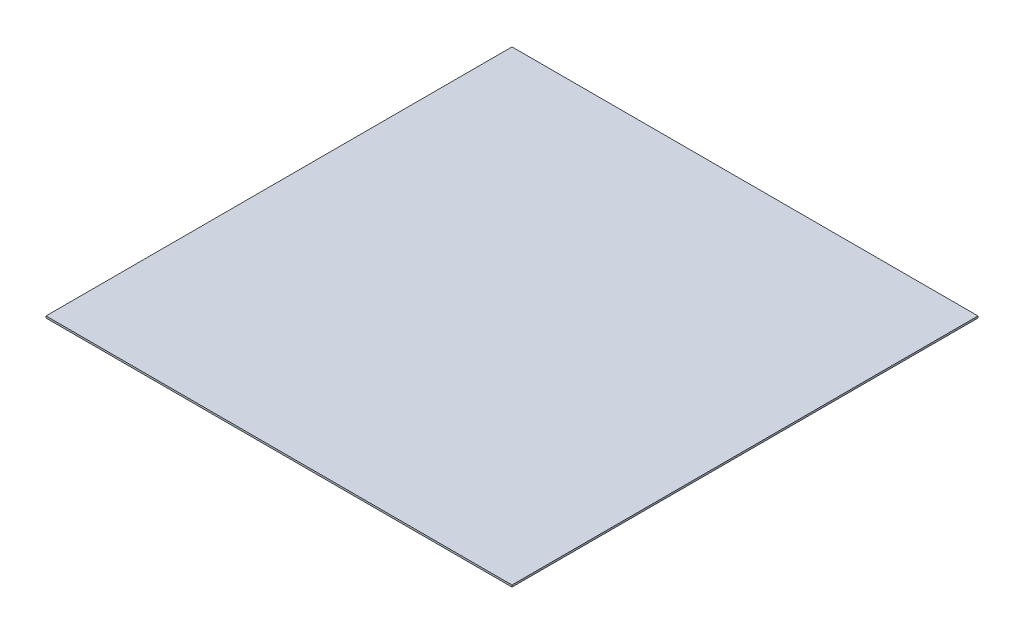
ISO-10303-21;
HEADER;
FILE_DESCRIPTION(('STEP AP214'),'2;1');
FILE_NAME('part.step','',(''),(''),'','','');
FILE_SCHEMA(('AUTOMOTIVE_DESIGN { 1 0 10303 214 1 1 1 1 }'));
ENDSEC;
DATA;
#1=APPLICATION_CONTEXT('core data for automotive mechanical design processes');
#2=APPLICATION_PROTOCOL_DEFINITION('international standard','automotive_design',2000,#1);
#3=PRODUCT_CONTEXT('',#1,'mechanical');
#4=PRODUCT('Part','Part','',(#3));
#5=PRODUCT_RELATED_PRODUCT_CATEGORY('part','',(#4));
#6=PRODUCT_DEFINITION_FORMATION('','',#4);
#7=PRODUCT_DEFINITION_CONTEXT('part definition',#1,'design');
#8=PRODUCT_DEFINITION('design','',#6,#7);
#9=PRODUCT_DEFINITION_SHAPE('','',#8);
#10=(LENGTH_UNIT() NAMED_UNIT(*) SI_UNIT(.MILLI.,.METRE.));
#11=(NAMED_UNIT(*) PLANE_ANGLE_UNIT() SI_UNIT($,.RADIAN.));
#12=(NAMED_UNIT(*) SI_UNIT($,.STERADIAN.) SOLID_ANGLE_UNIT());
#13=UNCERTAINTY_MEASURE_WITH_UNIT(LENGTH_MEASURE(1.E-05),#10,'distance_accuracy_value','');
#14=(GEOMETRIC_REPRESENTATION_CONTEXT(3) GLOBAL_UNCERTAINTY_ASSIGNED_CONTEXT((#13)) GLOBAL_UNIT_ASSIGNED_CONTEXT((#10,
#11,#12)) REPRESENTATION_CONTEXT('',''));
#15=CARTESIAN_POINT('',(0.,0.,0.));
#16=DIRECTION('',(0.,0.,1.));
#17=DIRECTION('',(1.,0.,0.));
#18=AXIS2_PLACEMENT_3D('',#15,#16,#17);
#19=CARTESIAN_POINT('',(12500.,100.,12500.));
#20=DIRECTION('',(-1.,0.,0.));
#21=DIRECTION('',(0.,0.,1.));
#22=AXIS2_PLACEMENT_3D('',#19,#20,#21);
#23=PLANE('',#22);
#24=DIRECTION('',(0.,0.,-1.));
#25=VECTOR('',#24,1.);
#26=CARTESIAN_POINT('',(12500.,0.,12500.));
#27=LINE('',#26,#25);
#28=CARTESIAN_POINT('',(12500.,0.,12500.));
#29=VERTEX_POINT('',#28);
#30=CARTESIAN_POINT('',(12500.,0.,-12500.));
#31=VERTEX_POINT('',#30);
#32=EDGE_CURVE('E98',#29,#31,#27,.T.);
#33=ORIENTED_EDGE('',*,*,#32,.T.);
#34=DIRECTION('',(0.,-1.,0.));
#35=VECTOR('',#34,1.);
#36=CARTESIAN_POINT('',(12500.,100.,-12500.));
#37=LINE('',#36,#35);
#38=CARTESIAN_POINT('',(12500.,100.,-12500.));
#39=VERTEX_POINT('',#38);
#40=EDGE_CURVE('E11',#39,#31,#37,.T.);
#41=ORIENTED_EDGE('',*,*,#40,.F.);
#42=DIRECTION('',(0.,0.,-1.));
#43=VECTOR('',#42,1.);
#44=CARTESIAN_POINT('',(12500.,100.,12500.));
#45=LINE('',#44,#43);
#46=CARTESIAN_POINT('',(12500.,100.,12500.));
#47=VERTEX_POINT('',#46);
#48=EDGE_CURVE('E86',#47,#39,#45,.T.);
#49=ORIENTED_EDGE('',*,*,#48,.F.);
#50=DIRECTION('',(0.,-1.,0.));
#51=VECTOR('',#50,1.);
#52=CARTESIAN_POINT('',(12500.,100.,12500.));
#53=LINE('',#52,#51);
#54=EDGE_CURVE('E94',#47,#29,#53,.T.);
#55=ORIENTED_EDGE('',*,*,#54,.T.);
#56=EDGE_LOOP('',(#33,#41,#49,#55));
#57=FACE_BOUND('',#56,.T.);
#58=ADVANCED_FACE('F35',(#57),#23,.F.);
#59=CARTESIAN_POINT('',(-12500.,100.,-12500.));
#60=DIRECTION('',(0.,0.,1.));
#61=DIRECTION('',(1.,0.,0.));
#62=AXIS2_PLACEMENT_3D('',#59,#60,#61);
#63=PLANE('',#62);
#64=DIRECTION('',(-1.,0.,0.));
#65=VECTOR('',#64,1.);
#66=CARTESIAN_POINT('',(-12500.,0.,-12500.));
#67=LINE('',#66,#65);
#68=CARTESIAN_POINT('',(-12500.,0.,-12500.));
#69=VERTEX_POINT('',#68);
#70=EDGE_CURVE('E90',#31,#69,#67,.T.);
#71=ORIENTED_EDGE('',*,*,#70,.T.);
#72=DIRECTION('',(0.,-1.,0.));
#73=VECTOR('',#72,1.);
#74=CARTESIAN_POINT('',(-12500.,100.,-12500.));
#75=LINE('',#74,#73);
#76=CARTESIAN_POINT('',(-12500.,100.,-12500.));
#77=VERTEX_POINT('',#76);
#78=EDGE_CURVE('E43',#77,#69,#75,.T.);
#79=ORIENTED_EDGE('',*,*,#78,.F.);
#80=DIRECTION('',(-1.,0.,0.));
#81=VECTOR('',#80,1.);
#82=CARTESIAN_POINT('',(-12500.,100.,-12500.));
#83=LINE('',#82,#81);
#84=EDGE_CURVE('E81',#39,#77,#83,.T.);
#85=ORIENTED_EDGE('',*,*,#84,.F.);
#86=ORIENTED_EDGE('',*,*,#40,.T.);
#87=EDGE_LOOP('',(#71,#79,#85,#86));
#88=FACE_BOUND('',#87,.T.);
#89=ADVANCED_FACE('F89',(#88),#63,.F.);
#90=CARTESIAN_POINT('',(-12500.,100.,12500.));
#91=DIRECTION('',(1.,0.,0.));
#92=DIRECTION('',(0.,0.,-1.));
#93=AXIS2_PLACEMENT_3D('',#90,#91,#92);
#94=PLANE('',#93);
#95=DIRECTION('',(0.,0.,1.));
#96=VECTOR('',#95,1.);
#97=CARTESIAN_POINT('',(-12500.,0.,12500.));
#98=LINE('',#97,#96);
#99=CARTESIAN_POINT('',(-12500.,0.,12500.));
#100=VERTEX_POINT('',#99);
#101=EDGE_CURVE('E68',#69,#100,#98,.T.);
#102=ORIENTED_EDGE('',*,*,#101,.T.);
#103=DIRECTION('',(0.,-1.,0.));
#104=VECTOR('',#103,1.);
#105=CARTESIAN_POINT('',(-12500.,100.,12500.));
#106=LINE('',#105,#104);
#107=CARTESIAN_POINT('',(-12500.,100.,12500.));
#108=VERTEX_POINT('',#107);
#109=EDGE_CURVE('E91',#108,#100,#106,.T.);
#110=ORIENTED_EDGE('',*,*,#109,.F.);
#111=DIRECTION('',(0.,0.,1.));
#112=VECTOR('',#111,1.);
#113=CARTESIAN_POINT('',(-12500.,100.,12500.));
#114=LINE('',#113,#112);
#115=EDGE_CURVE('E84',#77,#108,#114,.T.);
#116=ORIENTED_EDGE('',*,*,#115,.F.);
#117=ORIENTED_EDGE('',*,*,#78,.T.);
#118=EDGE_LOOP('',(#102,#110,#116,#117));
#119=FACE_BOUND('',#118,.T.);
#120=ADVANCED_FACE('F92',(#119),#94,.F.);
#121=CARTESIAN_POINT('',(-12500.,100.,12500.));
#122=DIRECTION('',(0.,0.,-1.));
#123=DIRECTION('',(-1.,0.,0.));
#124=AXIS2_PLACEMENT_3D('',#121,#122,#123);
#125=PLANE('',#124);
#126=DIRECTION('',(1.,0.,0.));
#127=VECTOR('',#126,1.);
#128=CARTESIAN_POINT('',(-12500.,0.,12500.));
#129=LINE('',#128,#127);
#130=EDGE_CURVE('E74',#100,#29,#129,.T.);
#131=ORIENTED_EDGE('',*,*,#130,.T.);
#132=ORIENTED_EDGE('',*,*,#54,.F.);
#133=DIRECTION('',(1.,0.,0.));
#134=VECTOR('',#133,1.);
#135=CARTESIAN_POINT('',(-12500.,100.,12500.));
#136=LINE('',#135,#134);
#137=EDGE_CURVE('E51',#108,#47,#136,.T.);
#138=ORIENTED_EDGE('',*,*,#137,.F.);
#139=ORIENTED_EDGE('',*,*,#109,.T.);
#140=EDGE_LOOP('',(#131,#132,#138,#139));
#141=FACE_BOUND('',#140,.T.);
#142=ADVANCED_FACE('F105',(#141),#125,.F.);
#143=CARTESIAN_POINT('',(0.,100.,0.));
#144=DIRECTION('',(0.,-1.,0.));
#145=DIRECTION('',(0.,0.,-1.));
#146=AXIS2_PLACEMENT_3D('',#143,#144,#145);
#147=PLANE('',#146);
#148=ORIENTED_EDGE('',*,*,#48,.T.);
#149=ORIENTED_EDGE('',*,*,#84,.T.);
#150=ORIENTED_EDGE('',*,*,#115,.T.);
#151=ORIENTED_EDGE('',*,*,#137,.T.);
#152=EDGE_LOOP('',(#148,#149,#150,#151));
#153=FACE_BOUND('',#152,.T.);
#154=ADVANCED_FACE('F82',(#153),#147,.F.);
#155=CARTESIAN_POINT('',(0.,0.,0.));
#156=DIRECTION('',(0.,-1.,0.));
#157=DIRECTION('',(0.,0.,-1.));
#158=AXIS2_PLACEMENT_3D('',#155,#156,#157);
#159=PLANE('',#158);
#160=ORIENTED_EDGE('',*,*,#32,.F.);
#161=ORIENTED_EDGE('',*,*,#130,.F.);
#162=ORIENTED_EDGE('',*,*,#101,.F.);
#163=ORIENTED_EDGE('',*,*,#70,.F.);
#164=EDGE_LOOP('',(#160,#161,#162,#163));
#165=FACE_BOUND('',#164,.T.);
#166=ADVANCED_FACE('F108',(#165),#159,.T.);
#167=CLOSED_SHELL('',(#58,#89,#120,#142,#154,#166));
#168=MANIFOLD_SOLID_BREP('B2',#167);
#169=ADVANCED_BREP_SHAPE_REPRESENTATION('',(#18,#168),#14);
#170=SHAPE_DEFINITION_REPRESENTATION(#9,#169);
ENDSEC;
END-ISO-10303-21;
